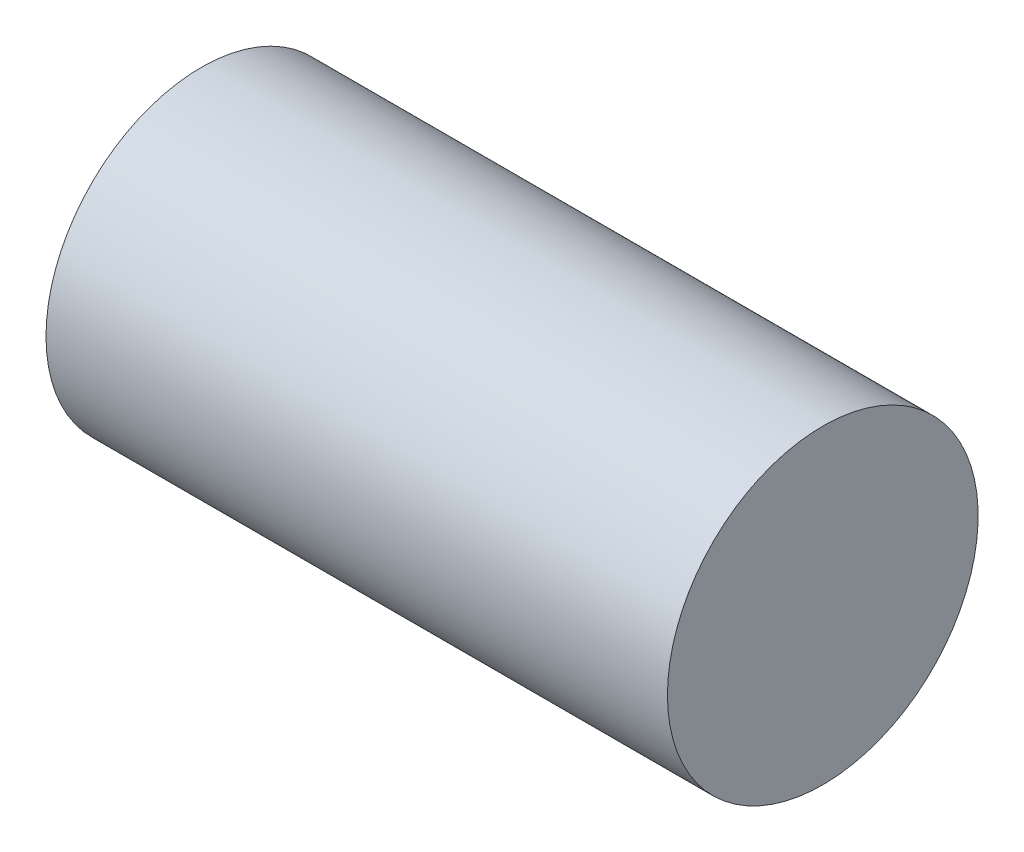
ISO-10303-21;
HEADER;
FILE_DESCRIPTION(('STEP AP214'),'2;1');
FILE_NAME('part.step','',(''),(''),'','','');
FILE_SCHEMA(('AUTOMOTIVE_DESIGN { 1 0 10303 214 1 1 1 1 }'));
ENDSEC;
DATA;
#1=APPLICATION_CONTEXT('core data for automotive mechanical design processes');
#2=APPLICATION_PROTOCOL_DEFINITION('international standard','automotive_design',2000,#1);
#3=PRODUCT_CONTEXT('',#1,'mechanical');
#4=PRODUCT('Part','Part','',(#3));
#5=PRODUCT_RELATED_PRODUCT_CATEGORY('part','',(#4));
#6=PRODUCT_DEFINITION_FORMATION('','',#4);
#7=PRODUCT_DEFINITION_CONTEXT('part definition',#1,'design');
#8=PRODUCT_DEFINITION('design','',#6,#7);
#9=PRODUCT_DEFINITION_SHAPE('','',#8);
#10=(LENGTH_UNIT() NAMED_UNIT(*) SI_UNIT(.MILLI.,.METRE.));
#11=(NAMED_UNIT(*) PLANE_ANGLE_UNIT() SI_UNIT($,.RADIAN.));
#12=(NAMED_UNIT(*) SI_UNIT($,.STERADIAN.) SOLID_ANGLE_UNIT());
#13=UNCERTAINTY_MEASURE_WITH_UNIT(LENGTH_MEASURE(1.E-05),#10,'distance_accuracy_value','');
#14=(GEOMETRIC_REPRESENTATION_CONTEXT(3) GLOBAL_UNCERTAINTY_ASSIGNED_CONTEXT((#13)) GLOBAL_UNIT_ASSIGNED_CONTEXT((#10,
#11,#12)) REPRESENTATION_CONTEXT('',''));
#15=CARTESIAN_POINT('',(0.,0.,0.));
#16=DIRECTION('',(0.,0.,1.));
#17=DIRECTION('',(1.,0.,0.));
#18=AXIS2_PLACEMENT_3D('',#15,#16,#17);
#19=CARTESIAN_POINT('',(0.,19.05,0.));
#20=DIRECTION('',(1.,0.,0.));
#21=DIRECTION('',(0.,0.,-1.));
#22=AXIS2_PLACEMENT_3D('',#19,#20,#21);
#23=PLANE('',#22);
#24=CARTESIAN_POINT('',(0.,0.,0.));
#25=DIRECTION('',(-1.,0.,0.));
#26=DIRECTION('',(0.,0.,1.));
#27=AXIS2_PLACEMENT_3D('',#24,#25,#26);
#28=CIRCLE('',#27,6.35);
#29=CARTESIAN_POINT('',(0.,0.,6.35));
#30=VERTEX_POINT('',#29);
#31=EDGE_CURVE('E10',#30,#30,#28,.T.);
#32=ORIENTED_EDGE('',*,*,#31,.F.);
#33=EDGE_LOOP('',(#32));
#34=FACE_BOUND('',#33,.T.);
#35=CARTESIAN_POINT('',(0.,0.,0.));
#36=DIRECTION('',(-1.,0.,0.));
#37=DIRECTION('',(0.,0.,1.));
#38=AXIS2_PLACEMENT_3D('',#35,#36,#37);
#39=CIRCLE('',#38,19.05);
#40=CARTESIAN_POINT('',(0.,0.,19.05));
#41=VERTEX_POINT('',#40);
#42=EDGE_CURVE('E45',#41,#41,#39,.T.);
#43=ORIENTED_EDGE('',*,*,#42,.T.);
#44=EDGE_LOOP('',(#43));
#45=FACE_BOUND('',#44,.T.);
#46=ADVANCED_FACE('F31',(#34,#45),#23,.F.);
#47=CARTESIAN_POINT('',(21.59,0.,0.));
#48=DIRECTION('',(-1.,0.,0.));
#49=DIRECTION('',(0.,0.,1.));
#50=AXIS2_PLACEMENT_3D('',#47,#48,#49);
#51=CYLINDRICAL_SURFACE('',#50,6.35);
#52=CARTESIAN_POINT('',(21.59,0.,0.));
#53=DIRECTION('',(-1.,0.,0.));
#54=DIRECTION('',(0.,0.,1.));
#55=AXIS2_PLACEMENT_3D('',#52,#53,#54);
#56=CIRCLE('',#55,6.35);
#57=CARTESIAN_POINT('',(21.59,0.,6.35));
#58=VERTEX_POINT('',#57);
#59=EDGE_CURVE('E37',#58,#58,#56,.T.);
#60=ORIENTED_EDGE('',*,*,#59,.F.);
#61=EDGE_LOOP('',(#60));
#62=FACE_BOUND('',#61,.T.);
#63=ORIENTED_EDGE('',*,*,#31,.T.);
#64=EDGE_LOOP('',(#63));
#65=FACE_BOUND('',#64,.T.);
#66=ADVANCED_FACE('F65',(#62,#65),#51,.F.);
#67=CARTESIAN_POINT('',(21.59,6.35,0.));
#68=DIRECTION('',(1.,0.,0.));
#69=DIRECTION('',(0.,0.,-1.));
#70=AXIS2_PLACEMENT_3D('',#67,#68,#69);
#71=PLANE('',#70);
#72=ORIENTED_EDGE('',*,*,#59,.T.);
#73=EDGE_LOOP('',(#72));
#74=FACE_BOUND('',#73,.T.);
#75=ADVANCED_FACE('F60',(#74),#71,.F.);
#76=CARTESIAN_POINT('',(76.2,0.,0.));
#77=DIRECTION('',(-1.,0.,0.));
#78=DIRECTION('',(0.,0.,1.));
#79=AXIS2_PLACEMENT_3D('',#76,#77,#78);
#80=PLANE('',#79);
#81=CARTESIAN_POINT('',(76.2,0.,0.));
#82=DIRECTION('',(-1.,0.,0.));
#83=DIRECTION('',(0.,0.,1.));
#84=AXIS2_PLACEMENT_3D('',#81,#82,#83);
#85=CIRCLE('',#84,19.05);
#86=CARTESIAN_POINT('',(76.2,0.,19.05));
#87=VERTEX_POINT('',#86);
#88=EDGE_CURVE('E41',#87,#87,#85,.T.);
#89=ORIENTED_EDGE('',*,*,#88,.F.);
#90=EDGE_LOOP('',(#89));
#91=FACE_BOUND('',#90,.T.);
#92=ADVANCED_FACE('F55',(#91),#80,.F.);
#93=CARTESIAN_POINT('',(21.59,0.,0.));
#94=DIRECTION('',(-1.,0.,0.));
#95=DIRECTION('',(0.,0.,1.));
#96=AXIS2_PLACEMENT_3D('',#93,#94,#95);
#97=CYLINDRICAL_SURFACE('',#96,19.05);
#98=ORIENTED_EDGE('',*,*,#42,.F.);
#99=EDGE_LOOP('',(#98));
#100=FACE_BOUND('',#99,.T.);
#101=ORIENTED_EDGE('',*,*,#88,.T.);
#102=EDGE_LOOP('',(#101));
#103=FACE_BOUND('',#102,.T.);
#104=ADVANCED_FACE('F52',(#100,#103),#97,.T.);
#105=CLOSED_SHELL('',(#46,#66,#75,#92,#104));
#106=MANIFOLD_SOLID_BREP('B2',#105);
#107=ADVANCED_BREP_SHAPE_REPRESENTATION('',(#18,#106),#14);
#108=SHAPE_DEFINITION_REPRESENTATION(#9,#107);
ENDSEC;
END-ISO-10303-21;
